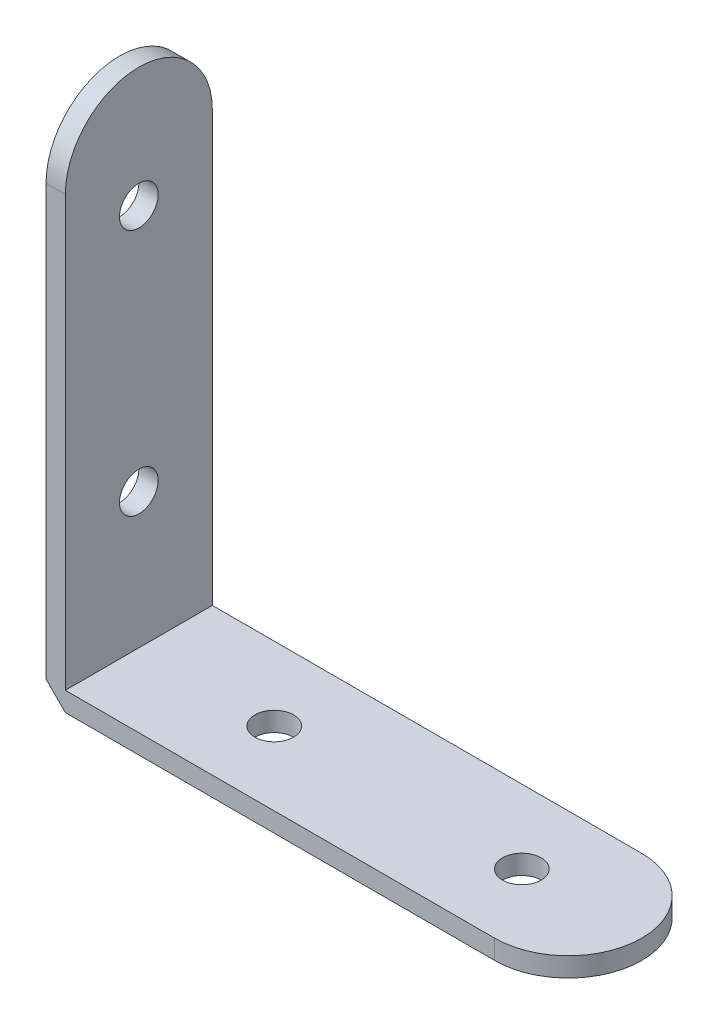
ISO-10303-21;
HEADER;
FILE_DESCRIPTION(('STEP AP214'),'2;1');
FILE_NAME('part.step','',(''),(''),'','','');
FILE_SCHEMA(('AUTOMOTIVE_DESIGN { 1 0 10303 214 1 1 1 1 }'));
ENDSEC;
DATA;
#1=APPLICATION_CONTEXT('core data for automotive mechanical design processes');
#2=APPLICATION_PROTOCOL_DEFINITION('international standard','automotive_design',2000,#1);
#3=PRODUCT_CONTEXT('',#1,'mechanical');
#4=PRODUCT('Part','Part','',(#3));
#5=PRODUCT_RELATED_PRODUCT_CATEGORY('part','',(#4));
#6=PRODUCT_DEFINITION_FORMATION('','',#4);
#7=PRODUCT_DEFINITION_CONTEXT('part definition',#1,'design');
#8=PRODUCT_DEFINITION('design','',#6,#7);
#9=PRODUCT_DEFINITION_SHAPE('','',#8);
#10=(LENGTH_UNIT() NAMED_UNIT(*) SI_UNIT(.MILLI.,.METRE.));
#11=(NAMED_UNIT(*) PLANE_ANGLE_UNIT() SI_UNIT($,.RADIAN.));
#12=(NAMED_UNIT(*) SI_UNIT($,.STERADIAN.) SOLID_ANGLE_UNIT());
#13=UNCERTAINTY_MEASURE_WITH_UNIT(LENGTH_MEASURE(1.E-05),#10,'distance_accuracy_value','');
#14=(GEOMETRIC_REPRESENTATION_CONTEXT(3) GLOBAL_UNCERTAINTY_ASSIGNED_CONTEXT((#13)) GLOBAL_UNIT_ASSIGNED_CONTEXT((#10,
#11,#12)) REPRESENTATION_CONTEXT('',''));
#15=CARTESIAN_POINT('',(0.,0.,0.));
#16=DIRECTION('',(0.,0.,1.));
#17=DIRECTION('',(1.,0.,0.));
#18=AXIS2_PLACEMENT_3D('',#15,#16,#17);
#19=CARTESIAN_POINT('',(-32.5,2.5,-9.50000000000001));
#20=DIRECTION('',(1.,0.,0.));
#21=DIRECTION('',(0.,0.,-1.));
#22=AXIS2_PLACEMENT_3D('',#19,#20,#21);
#23=PLANE('',#22);
#24=CARTESIAN_POINT('',(-32.5,52.,0.));
#25=DIRECTION('',(1.,0.,0.));
#26=DIRECTION('',(0.,0.,-1.));
#27=AXIS2_PLACEMENT_3D('',#24,#25,#26);
#28=CIRCLE('',#27,2.5);
#29=CARTESIAN_POINT('',(-32.5,52.,-2.5));
#30=VERTEX_POINT('',#29);
#31=EDGE_CURVE('E123',#30,#30,#28,.T.);
#32=ORIENTED_EDGE('',*,*,#31,.F.);
#33=EDGE_LOOP('',(#32));
#34=FACE_BOUND('',#33,.T.);
#35=CARTESIAN_POINT('',(-32.5,20.,0.));
#36=DIRECTION('',(1.,0.,0.));
#37=DIRECTION('',(0.,0.,-1.));
#38=AXIS2_PLACEMENT_3D('',#35,#36,#37);
#39=CIRCLE('',#38,2.5);
#40=CARTESIAN_POINT('',(-32.5,20.,-2.5));
#41=VERTEX_POINT('',#40);
#42=EDGE_CURVE('E129',#41,#41,#39,.T.);
#43=ORIENTED_EDGE('',*,*,#42,.F.);
#44=EDGE_LOOP('',(#43));
#45=FACE_BOUND('',#44,.T.);
#46=CARTESIAN_POINT('',(-32.5,58.,0.));
#47=DIRECTION('',(1.,0.,0.));
#48=DIRECTION('',(0.,0.,-1.));
#49=AXIS2_PLACEMENT_3D('',#46,#47,#48);
#50=CIRCLE('',#49,9.5);
#51=CARTESIAN_POINT('',(-32.5,58.,-9.50000000000001));
#52=VERTEX_POINT('',#51);
#53=CARTESIAN_POINT('',(-32.5,58.,9.49999999999999));
#54=VERTEX_POINT('',#53);
#55=EDGE_CURVE('E91',#52,#54,#50,.T.);
#56=ORIENTED_EDGE('',*,*,#55,.T.);
#57=DIRECTION('',(0.,1.,0.));
#58=VECTOR('',#57,1.);
#59=CARTESIAN_POINT('',(-32.5,2.5,9.49999999999999));
#60=LINE('',#59,#58);
#61=CARTESIAN_POINT('',(-32.5,2.5,9.5));
#62=VERTEX_POINT('',#61);
#63=EDGE_CURVE('E87',#62,#54,#60,.T.);
#64=ORIENTED_EDGE('',*,*,#63,.F.);
#65=DIRECTION('',(0.,0.,1.));
#66=VECTOR('',#65,1.);
#67=CARTESIAN_POINT('',(-32.5,2.5,9.5));
#68=LINE('',#67,#66);
#69=CARTESIAN_POINT('',(-32.5,2.5,-9.50000000000001));
#70=VERTEX_POINT('',#69);
#71=EDGE_CURVE('E77',#70,#62,#68,.T.);
#72=ORIENTED_EDGE('',*,*,#71,.F.);
#73=DIRECTION('',(0.,1.,0.));
#74=VECTOR('',#73,1.);
#75=CARTESIAN_POINT('',(-32.5,2.5,-9.50000000000001));
#76=LINE('',#75,#74);
#77=EDGE_CURVE('E143',#70,#52,#76,.T.);
#78=ORIENTED_EDGE('',*,*,#77,.T.);
#79=EDGE_LOOP('',(#56,#64,#72,#78));
#80=FACE_BOUND('',#79,.T.);
#81=ADVANCED_FACE('F37',(#34,#45,#80),#23,.T.);
#82=CARTESIAN_POINT('',(-35.,2.5,-9.50000000000001));
#83=DIRECTION('',(-1.,0.,0.));
#84=DIRECTION('',(0.,0.,1.));
#85=AXIS2_PLACEMENT_3D('',#82,#83,#84);
#86=PLANE('',#85);
#87=CARTESIAN_POINT('',(-35.,52.,0.));
#88=DIRECTION('',(-1.,0.,0.));
#89=DIRECTION('',(0.,0.,1.));
#90=AXIS2_PLACEMENT_3D('',#87,#88,#89);
#91=CIRCLE('',#90,2.5);
#92=CARTESIAN_POINT('',(-35.,52.,2.5));
#93=VERTEX_POINT('',#92);
#94=EDGE_CURVE('E41',#93,#93,#91,.T.);
#95=ORIENTED_EDGE('',*,*,#94,.F.);
#96=EDGE_LOOP('',(#95));
#97=FACE_BOUND('',#96,.T.);
#98=CARTESIAN_POINT('',(-35.,20.,0.));
#99=DIRECTION('',(-1.,0.,0.));
#100=DIRECTION('',(0.,0.,1.));
#101=AXIS2_PLACEMENT_3D('',#98,#99,#100);
#102=CIRCLE('',#101,2.5);
#103=CARTESIAN_POINT('',(-35.,20.,2.5));
#104=VERTEX_POINT('',#103);
#105=EDGE_CURVE('E121',#104,#104,#102,.T.);
#106=ORIENTED_EDGE('',*,*,#105,.F.);
#107=EDGE_LOOP('',(#106));
#108=FACE_BOUND('',#107,.T.);
#109=DIRECTION('',(0.,-1.,0.));
#110=VECTOR('',#109,1.);
#111=CARTESIAN_POINT('',(-35.,2.5,9.49999999999999));
#112=LINE('',#111,#110);
#113=CARTESIAN_POINT('',(-35.,58.,9.49999999999999));
#114=VERTEX_POINT('',#113);
#115=CARTESIAN_POINT('',(-35.,2.5,9.49999999999999));
#116=VERTEX_POINT('',#115);
#117=EDGE_CURVE('E94',#114,#116,#112,.T.);
#118=ORIENTED_EDGE('',*,*,#117,.F.);
#119=CARTESIAN_POINT('',(-35.,58.,0.));
#120=DIRECTION('',(-1.,0.,0.));
#121=DIRECTION('',(0.,0.,1.));
#122=AXIS2_PLACEMENT_3D('',#119,#120,#121);
#123=CIRCLE('',#122,9.5);
#124=CARTESIAN_POINT('',(-35.,58.,-9.50000000000001));
#125=VERTEX_POINT('',#124);
#126=EDGE_CURVE('E95',#114,#125,#123,.T.);
#127=ORIENTED_EDGE('',*,*,#126,.T.);
#128=DIRECTION('',(0.,-1.,0.));
#129=VECTOR('',#128,1.);
#130=CARTESIAN_POINT('',(-35.,2.5,-9.50000000000001));
#131=LINE('',#130,#129);
#132=CARTESIAN_POINT('',(-35.,2.5,-9.50000000000001));
#133=VERTEX_POINT('',#132);
#134=EDGE_CURVE('E145',#125,#133,#131,.T.);
#135=ORIENTED_EDGE('',*,*,#134,.T.);
#136=DIRECTION('',(0.,0.,1.));
#137=VECTOR('',#136,1.);
#138=CARTESIAN_POINT('',(-35.,2.5,-9.50000000000001));
#139=LINE('',#138,#137);
#140=EDGE_CURVE('E150',#133,#116,#139,.T.);
#141=ORIENTED_EDGE('',*,*,#140,.T.);
#142=EDGE_LOOP('',(#118,#127,#135,#141));
#143=FACE_BOUND('',#142,.T.);
#144=ADVANCED_FACE('F188',(#97,#108,#143),#86,.T.);
#145=CARTESIAN_POINT('',(23.,2.5,9.49999999999999));
#146=DIRECTION('',(0.,0.,-1.));
#147=DIRECTION('',(-1.,0.,0.));
#148=AXIS2_PLACEMENT_3D('',#145,#146,#147);
#149=PLANE('',#148);
#150=DIRECTION('',(1.,0.,0.));
#151=VECTOR('',#150,1.);
#152=CARTESIAN_POINT('',(-51.5,58.,9.49999999999999));
#153=LINE('',#152,#151);
#154=EDGE_CURVE('E127',#114,#54,#153,.T.);
#155=ORIENTED_EDGE('',*,*,#154,.F.);
#156=ORIENTED_EDGE('',*,*,#117,.T.);
#157=DIRECTION('',(0.707106781186548,-0.707106781186547,0.));
#158=VECTOR('',#157,1.);
#159=CARTESIAN_POINT('',(-35.,2.5,9.49999999999999));
#160=LINE('',#159,#158);
#161=CARTESIAN_POINT('',(-32.5,0.,9.49999999999999));
#162=VERTEX_POINT('',#161);
#163=EDGE_CURVE('E146',#116,#162,#160,.T.);
#164=ORIENTED_EDGE('',*,*,#163,.T.);
#165=DIRECTION('',(1.,0.,0.));
#166=VECTOR('',#165,1.);
#167=CARTESIAN_POINT('',(23.,0.,9.49999999999999));
#168=LINE('',#167,#166);
#169=CARTESIAN_POINT('',(23.,0.,9.49999999999999));
#170=VERTEX_POINT('',#169);
#171=EDGE_CURVE('E68',#162,#170,#168,.T.);
#172=ORIENTED_EDGE('',*,*,#171,.T.);
#173=DIRECTION('',(0.,-1.,0.));
#174=VECTOR('',#173,1.);
#175=CARTESIAN_POINT('',(23.,2.5,9.49999999999999));
#176=LINE('',#175,#174);
#177=CARTESIAN_POINT('',(23.,2.5,9.49999999999999));
#178=VERTEX_POINT('',#177);
#179=EDGE_CURVE('E11',#178,#170,#176,.T.);
#180=ORIENTED_EDGE('',*,*,#179,.F.);
#181=DIRECTION('',(1.,0.,0.));
#182=VECTOR('',#181,1.);
#183=CARTESIAN_POINT('',(23.,2.5,9.49999999999999));
#184=LINE('',#183,#182);
#185=EDGE_CURVE('E97',#62,#178,#184,.T.);
#186=ORIENTED_EDGE('',*,*,#185,.F.);
#187=ORIENTED_EDGE('',*,*,#63,.T.);
#188=EDGE_LOOP('',(#155,#156,#164,#172,#180,#186,#187));
#189=FACE_BOUND('',#188,.T.);
#190=ADVANCED_FACE('F39',(#189),#149,.F.);
#191=CARTESIAN_POINT('',(23.,2.5,0.));
#192=DIRECTION('',(0.,1.,0.));
#193=DIRECTION('',(0.,0.,1.));
#194=AXIS2_PLACEMENT_3D('',#191,#192,#193);
#195=PLANE('',#194);
#196=CARTESIAN_POINT('',(-15.,2.5,0.));
#197=DIRECTION('',(0.,1.,0.));
#198=DIRECTION('',(0.,0.,1.));
#199=AXIS2_PLACEMENT_3D('',#196,#197,#198);
#200=CIRCLE('',#199,2.5);
#201=CARTESIAN_POINT('',(-15.,2.5,2.5));
#202=VERTEX_POINT('',#201);
#203=EDGE_CURVE('E117',#202,#202,#200,.T.);
#204=ORIENTED_EDGE('',*,*,#203,.F.);
#205=EDGE_LOOP('',(#204));
#206=FACE_BOUND('',#205,.T.);
#207=ORIENTED_EDGE('',*,*,#71,.T.);
#208=ORIENTED_EDGE('',*,*,#185,.T.);
#209=CARTESIAN_POINT('',(23.,2.5,0.));
#210=DIRECTION('',(0.,1.,0.));
#211=DIRECTION('',(0.,0.,1.));
#212=AXIS2_PLACEMENT_3D('',#209,#210,#211);
#213=CIRCLE('',#212,9.5);
#214=CARTESIAN_POINT('',(23.,2.5,-9.50000000000001));
#215=VERTEX_POINT('',#214);
#216=EDGE_CURVE('E56',#178,#215,#213,.T.);
#217=ORIENTED_EDGE('',*,*,#216,.T.);
#218=DIRECTION('',(-1.,0.,0.));
#219=VECTOR('',#218,1.);
#220=CARTESIAN_POINT('',(23.,2.5,-9.50000000000001));
#221=LINE('',#220,#219);
#222=EDGE_CURVE('E102',#215,#70,#221,.T.);
#223=ORIENTED_EDGE('',*,*,#222,.T.);
#224=EDGE_LOOP('',(#207,#208,#217,#223));
#225=FACE_BOUND('',#224,.T.);
#226=CARTESIAN_POINT('',(17.,2.5,0.));
#227=DIRECTION('',(0.,1.,0.));
#228=DIRECTION('',(0.,0.,1.));
#229=AXIS2_PLACEMENT_3D('',#226,#227,#228);
#230=CIRCLE('',#229,2.5);
#231=CARTESIAN_POINT('',(17.,2.5,2.49999999999999));
#232=VERTEX_POINT('',#231);
#233=EDGE_CURVE('E158',#232,#232,#230,.T.);
#234=ORIENTED_EDGE('',*,*,#233,.F.);
#235=EDGE_LOOP('',(#234));
#236=FACE_BOUND('',#235,.T.);
#237=ADVANCED_FACE('F99',(#206,#225,#236),#195,.T.);
#238=CARTESIAN_POINT('',(23.,0.,0.));
#239=DIRECTION('',(0.,1.,0.));
#240=DIRECTION('',(0.,0.,1.));
#241=AXIS2_PLACEMENT_3D('',#238,#239,#240);
#242=PLANE('',#241);
#243=DIRECTION('',(0.,0.,1.));
#244=VECTOR('',#243,1.);
#245=CARTESIAN_POINT('',(-32.5,0.,9.5));
#246=LINE('',#245,#244);
#247=CARTESIAN_POINT('',(-32.5,0.,-9.50000000000001));
#248=VERTEX_POINT('',#247);
#249=EDGE_CURVE('E114',#248,#162,#246,.T.);
#250=ORIENTED_EDGE('',*,*,#249,.F.);
#251=DIRECTION('',(-1.,0.,0.));
#252=VECTOR('',#251,1.);
#253=CARTESIAN_POINT('',(23.,0.,-9.50000000000001));
#254=LINE('',#253,#252);
#255=CARTESIAN_POINT('',(23.,0.,-9.50000000000001));
#256=VERTEX_POINT('',#255);
#257=EDGE_CURVE('E103',#256,#248,#254,.T.);
#258=ORIENTED_EDGE('',*,*,#257,.F.);
#259=CARTESIAN_POINT('',(23.,0.,0.));
#260=DIRECTION('',(0.,1.,0.));
#261=DIRECTION('',(0.,0.,1.));
#262=AXIS2_PLACEMENT_3D('',#259,#260,#261);
#263=CIRCLE('',#262,9.5);
#264=EDGE_CURVE('E106',#170,#256,#263,.T.);
#265=ORIENTED_EDGE('',*,*,#264,.F.);
#266=ORIENTED_EDGE('',*,*,#171,.F.);
#267=EDGE_LOOP('',(#250,#258,#265,#266));
#268=FACE_BOUND('',#267,.T.);
#269=CARTESIAN_POINT('',(-15.,0.,0.));
#270=DIRECTION('',(0.,1.,0.));
#271=DIRECTION('',(0.,0.,1.));
#272=AXIS2_PLACEMENT_3D('',#269,#270,#271);
#273=CIRCLE('',#272,2.5);
#274=CARTESIAN_POINT('',(-15.,0.,2.5));
#275=VERTEX_POINT('',#274);
#276=EDGE_CURVE('E109',#275,#275,#273,.T.);
#277=ORIENTED_EDGE('',*,*,#276,.T.);
#278=EDGE_LOOP('',(#277));
#279=FACE_BOUND('',#278,.T.);
#280=CARTESIAN_POINT('',(17.,0.,0.));
#281=DIRECTION('',(0.,1.,0.));
#282=DIRECTION('',(0.,0.,1.));
#283=AXIS2_PLACEMENT_3D('',#280,#281,#282);
#284=CIRCLE('',#283,2.5);
#285=CARTESIAN_POINT('',(17.,0.,2.49999999999999));
#286=VERTEX_POINT('',#285);
#287=EDGE_CURVE('E157',#286,#286,#284,.T.);
#288=ORIENTED_EDGE('',*,*,#287,.T.);
#289=EDGE_LOOP('',(#288));
#290=FACE_BOUND('',#289,.T.);
#291=ADVANCED_FACE('F168',(#268,#279,#290),#242,.F.);
#292=CARTESIAN_POINT('',(23.,2.5,0.));
#293=DIRECTION('',(0.,-1.,0.));
#294=DIRECTION('',(0.,0.,-1.));
#295=AXIS2_PLACEMENT_3D('',#292,#293,#294);
#296=CYLINDRICAL_SURFACE('',#295,9.5);
#297=ORIENTED_EDGE('',*,*,#264,.T.);
#298=DIRECTION('',(0.,-1.,0.));
#299=VECTOR('',#298,1.);
#300=CARTESIAN_POINT('',(23.,2.5,-9.50000000000001));
#301=LINE('',#300,#299);
#302=EDGE_CURVE('E47',#215,#256,#301,.T.);
#303=ORIENTED_EDGE('',*,*,#302,.F.);
#304=ORIENTED_EDGE('',*,*,#216,.F.);
#305=ORIENTED_EDGE('',*,*,#179,.T.);
#306=EDGE_LOOP('',(#297,#303,#304,#305));
#307=FACE_BOUND('',#306,.T.);
#308=ADVANCED_FACE('F183',(#307),#296,.T.);
#309=CARTESIAN_POINT('',(23.,2.5,-9.50000000000001));
#310=DIRECTION('',(0.,0.,1.));
#311=DIRECTION('',(1.,0.,0.));
#312=AXIS2_PLACEMENT_3D('',#309,#310,#311);
#313=PLANE('',#312);
#314=ORIENTED_EDGE('',*,*,#134,.F.);
#315=DIRECTION('',(1.,0.,0.));
#316=VECTOR('',#315,1.);
#317=CARTESIAN_POINT('',(-51.5,58.,-9.50000000000001));
#318=LINE('',#317,#316);
#319=EDGE_CURVE('E138',#125,#52,#318,.T.);
#320=ORIENTED_EDGE('',*,*,#319,.T.);
#321=ORIENTED_EDGE('',*,*,#77,.F.);
#322=ORIENTED_EDGE('',*,*,#222,.F.);
#323=ORIENTED_EDGE('',*,*,#302,.T.);
#324=ORIENTED_EDGE('',*,*,#257,.T.);
#325=DIRECTION('',(0.707106781186548,-0.707106781186547,0.));
#326=VECTOR('',#325,1.);
#327=CARTESIAN_POINT('',(-35.,2.5,-9.50000000000001));
#328=LINE('',#327,#326);
#329=EDGE_CURVE('E149',#133,#248,#328,.T.);
#330=ORIENTED_EDGE('',*,*,#329,.F.);
#331=EDGE_LOOP('',(#314,#320,#321,#322,#323,#324,#330));
#332=FACE_BOUND('',#331,.T.);
#333=ADVANCED_FACE('F174',(#332),#313,.F.);
#334=CARTESIAN_POINT('',(-15.,2.5,0.));
#335=DIRECTION('',(0.,-1.,0.));
#336=DIRECTION('',(0.,0.,-1.));
#337=AXIS2_PLACEMENT_3D('',#334,#335,#336);
#338=CYLINDRICAL_SURFACE('',#337,2.5);
#339=ORIENTED_EDGE('',*,*,#203,.T.);
#340=EDGE_LOOP('',(#339));
#341=FACE_BOUND('',#340,.T.);
#342=ORIENTED_EDGE('',*,*,#276,.F.);
#343=EDGE_LOOP('',(#342));
#344=FACE_BOUND('',#343,.T.);
#345=ADVANCED_FACE('F171',(#341,#344),#338,.F.);
#346=CARTESIAN_POINT('',(17.,2.5,0.));
#347=DIRECTION('',(0.,-1.,0.));
#348=DIRECTION('',(0.,0.,-1.));
#349=AXIS2_PLACEMENT_3D('',#346,#347,#348);
#350=CYLINDRICAL_SURFACE('',#349,2.5);
#351=ORIENTED_EDGE('',*,*,#233,.T.);
#352=EDGE_LOOP('',(#351));
#353=FACE_BOUND('',#352,.T.);
#354=ORIENTED_EDGE('',*,*,#287,.F.);
#355=EDGE_LOOP('',(#354));
#356=FACE_BOUND('',#355,.T.);
#357=ADVANCED_FACE('F173',(#353,#356),#350,.F.);
#358=CARTESIAN_POINT('',(-35.,2.5,-9.50000000000001));
#359=DIRECTION('',(-0.707106781186547,-0.707106781186548,0.));
#360=DIRECTION('',(0.707106781186548,-0.707106781186547,0.));
#361=AXIS2_PLACEMENT_3D('',#358,#359,#360);
#362=PLANE('',#361);
#363=ORIENTED_EDGE('',*,*,#163,.F.);
#364=ORIENTED_EDGE('',*,*,#140,.F.);
#365=ORIENTED_EDGE('',*,*,#329,.T.);
#366=ORIENTED_EDGE('',*,*,#249,.T.);
#367=EDGE_LOOP('',(#363,#364,#365,#366));
#368=FACE_BOUND('',#367,.T.);
#369=ADVANCED_FACE('F180',(#368),#362,.T.);
#370=CARTESIAN_POINT('',(-51.5,58.,0.));
#371=DIRECTION('',(1.,0.,0.));
#372=DIRECTION('',(0.,0.,-1.));
#373=AXIS2_PLACEMENT_3D('',#370,#371,#372);
#374=CYLINDRICAL_SURFACE('',#373,9.5);
#375=ORIENTED_EDGE('',*,*,#126,.F.);
#376=ORIENTED_EDGE('',*,*,#154,.T.);
#377=ORIENTED_EDGE('',*,*,#55,.F.);
#378=ORIENTED_EDGE('',*,*,#319,.F.);
#379=EDGE_LOOP('',(#375,#376,#377,#378));
#380=FACE_BOUND('',#379,.T.);
#381=ADVANCED_FACE('F200',(#380),#374,.T.);
#382=CARTESIAN_POINT('',(-51.5,20.,0.));
#383=DIRECTION('',(1.,0.,0.));
#384=DIRECTION('',(0.,0.,-1.));
#385=AXIS2_PLACEMENT_3D('',#382,#383,#384);
#386=CYLINDRICAL_SURFACE('',#385,2.5);
#387=ORIENTED_EDGE('',*,*,#105,.T.);
#388=EDGE_LOOP('',(#387));
#389=FACE_BOUND('',#388,.T.);
#390=ORIENTED_EDGE('',*,*,#42,.T.);
#391=EDGE_LOOP('',(#390));
#392=FACE_BOUND('',#391,.T.);
#393=ADVANCED_FACE('F204',(#389,#392),#386,.F.);
#394=CARTESIAN_POINT('',(-51.5,52.,0.));
#395=DIRECTION('',(1.,0.,0.));
#396=DIRECTION('',(0.,0.,-1.));
#397=AXIS2_PLACEMENT_3D('',#394,#395,#396);
#398=CYLINDRICAL_SURFACE('',#397,2.5);
#399=ORIENTED_EDGE('',*,*,#94,.T.);
#400=EDGE_LOOP('',(#399));
#401=FACE_BOUND('',#400,.T.);
#402=ORIENTED_EDGE('',*,*,#31,.T.);
#403=EDGE_LOOP('',(#402));
#404=FACE_BOUND('',#403,.T.);
#405=ADVANCED_FACE('F208',(#401,#404),#398,.F.);
#406=CLOSED_SHELL('',(#81,#144,#190,#237,#291,#308,#333,#345,#357,#369,#381,#393,#405));
#407=MANIFOLD_SOLID_BREP('B2',#406);
#408=ADVANCED_BREP_SHAPE_REPRESENTATION('',(#18,#407),#14);
#409=SHAPE_DEFINITION_REPRESENTATION(#9,#408);
ENDSEC;
END-ISO-10303-21;
